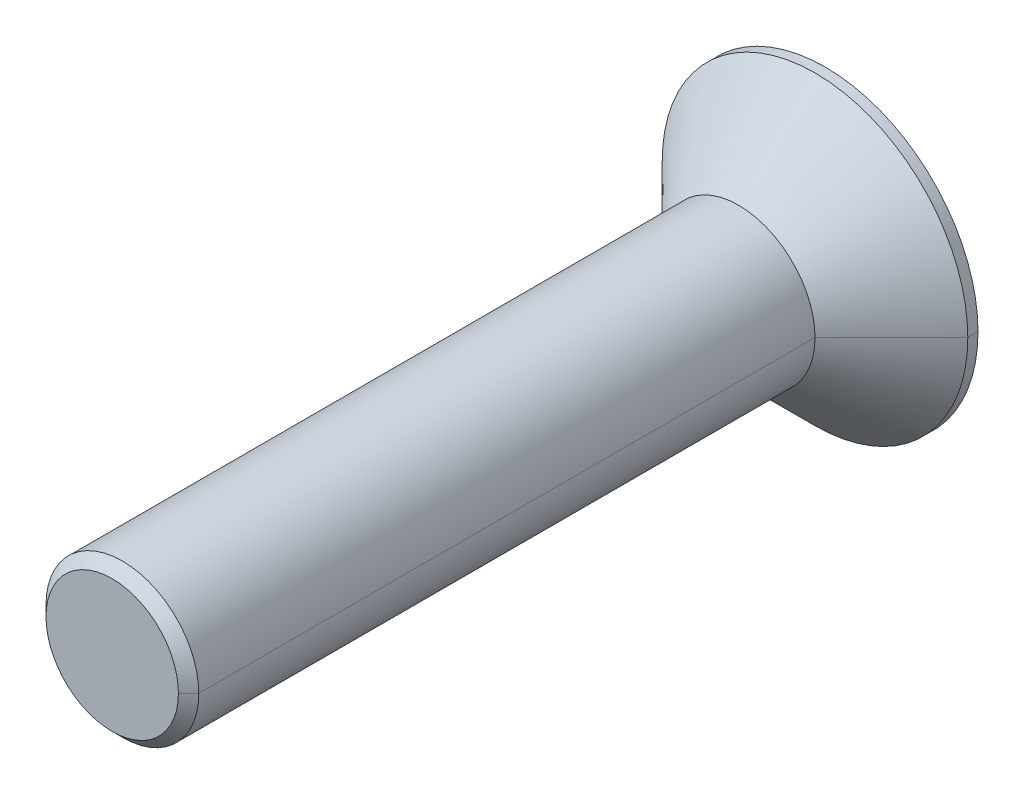
ISO-10303-21;
HEADER;
FILE_DESCRIPTION(('STEP AP214'),'2;1');
FILE_NAME('part.step','',(''),(''),'','','');
FILE_SCHEMA(('AUTOMOTIVE_DESIGN { 1 0 10303 214 1 1 1 1 }'));
ENDSEC;
DATA;
#1=APPLICATION_CONTEXT('core data for automotive mechanical design processes');
#2=APPLICATION_PROTOCOL_DEFINITION('international standard','automotive_design',2000,#1);
#3=PRODUCT_CONTEXT('',#1,'mechanical');
#4=PRODUCT('Part','Part','',(#3));
#5=PRODUCT_RELATED_PRODUCT_CATEGORY('part','',(#4));
#6=PRODUCT_DEFINITION_FORMATION('','',#4);
#7=PRODUCT_DEFINITION_CONTEXT('part definition',#1,'design');
#8=PRODUCT_DEFINITION('design','',#6,#7);
#9=PRODUCT_DEFINITION_SHAPE('','',#8);
#10=(LENGTH_UNIT() NAMED_UNIT(*) SI_UNIT(.MILLI.,.METRE.));
#11=(NAMED_UNIT(*) PLANE_ANGLE_UNIT() SI_UNIT($,.RADIAN.));
#12=(NAMED_UNIT(*) SI_UNIT($,.STERADIAN.) SOLID_ANGLE_UNIT());
#13=UNCERTAINTY_MEASURE_WITH_UNIT(LENGTH_MEASURE(1.E-05),#10,'distance_accuracy_value','');
#14=(GEOMETRIC_REPRESENTATION_CONTEXT(3) GLOBAL_UNCERTAINTY_ASSIGNED_CONTEXT((#13)) GLOBAL_UNIT_ASSIGNED_CONTEXT((#10,
#11,#12)) REPRESENTATION_CONTEXT('',''));
#15=CARTESIAN_POINT('',(0.,0.,0.));
#16=DIRECTION('',(0.,0.,1.));
#17=DIRECTION('',(1.,0.,0.));
#18=AXIS2_PLACEMENT_3D('',#15,#16,#17);
#19=CARTESIAN_POINT('',(0.,0.,-0.2));
#20=DIRECTION('',(0.,0.,-1.));
#21=DIRECTION('',(0.,-1.,0.));
#22=AXIS2_PLACEMENT_3D('',#19,#20,#21);
#23=PLANE('',#22);
#24=DIRECTION('',(-0.5,-0.866025403784439,0.));
#25=VECTOR('',#24,1.);
#26=CARTESIAN_POINT('',(1.15470053837925,0.,-0.2));
#27=LINE('',#26,#25);
#28=CARTESIAN_POINT('',(1.15470053837925,0.,-0.2));
#29=VERTEX_POINT('',#28);
#30=CARTESIAN_POINT('',(0.577350269189626,-1.,-0.2));
#31=VERTEX_POINT('',#30);
#32=EDGE_CURVE('E242',#29,#31,#27,.T.);
#33=ORIENTED_EDGE('',*,*,#32,.T.);
#34=DIRECTION('',(-1.,0.,0.));
#35=VECTOR('',#34,1.);
#36=CARTESIAN_POINT('',(0.577350269189626,-1.,-0.2));
#37=LINE('',#36,#35);
#38=CARTESIAN_POINT('',(-0.577350269189626,-1.,-0.2));
#39=VERTEX_POINT('',#38);
#40=EDGE_CURVE('E11',#31,#39,#37,.T.);
#41=ORIENTED_EDGE('',*,*,#40,.T.);
#42=DIRECTION('',(-0.5,0.866025403784439,0.));
#43=VECTOR('',#42,1.);
#44=CARTESIAN_POINT('',(-0.577350269189626,-1.,-0.2));
#45=LINE('',#44,#43);
#46=CARTESIAN_POINT('',(-1.15470053837925,0.,-0.2));
#47=VERTEX_POINT('',#46);
#48=EDGE_CURVE('E44',#39,#47,#45,.T.);
#49=ORIENTED_EDGE('',*,*,#48,.T.);
#50=DIRECTION('',(0.5,0.866025403784439,0.));
#51=VECTOR('',#50,1.);
#52=CARTESIAN_POINT('',(-1.15470053837925,0.,-0.2));
#53=LINE('',#52,#51);
#54=CARTESIAN_POINT('',(-0.577350269189627,1.,-0.2));
#55=VERTEX_POINT('',#54);
#56=EDGE_CURVE('E255',#47,#55,#53,.T.);
#57=ORIENTED_EDGE('',*,*,#56,.T.);
#58=DIRECTION('',(1.,0.,0.));
#59=VECTOR('',#58,1.);
#60=CARTESIAN_POINT('',(-0.577350269189627,1.,-0.2));
#61=LINE('',#60,#59);
#62=CARTESIAN_POINT('',(0.577350269189626,1.,-0.2));
#63=VERTEX_POINT('',#62);
#64=EDGE_CURVE('E209',#55,#63,#61,.T.);
#65=ORIENTED_EDGE('',*,*,#64,.T.);
#66=DIRECTION('',(0.5,-0.866025403784439,0.));
#67=VECTOR('',#66,1.);
#68=CARTESIAN_POINT('',(0.577350269189626,1.,-0.2));
#69=LINE('',#68,#67);
#70=EDGE_CURVE('E248',#63,#29,#69,.T.);
#71=ORIENTED_EDGE('',*,*,#70,.T.);
#72=EDGE_LOOP('',(#33,#41,#49,#57,#65,#71));
#73=FACE_BOUND('',#72,.T.);
#74=ADVANCED_FACE('F17',(#73),#23,.T.);
#75=CARTESIAN_POINT('',(0.577350269189626,-1.,-0.2));
#76=DIRECTION('',(0.,-1.,0.));
#77=DIRECTION('',(0.,0.,-1.));
#78=AXIS2_PLACEMENT_3D('',#75,#76,#77);
#79=PLANE('',#78);
#80=DIRECTION('',(-1.,0.,0.));
#81=VECTOR('',#80,1.);
#82=CARTESIAN_POINT('',(0.577350269189626,-1.,-1.7));
#83=LINE('',#82,#81);
#84=CARTESIAN_POINT('',(0.577350269189626,-1.,-1.7));
#85=VERTEX_POINT('',#84);
#86=CARTESIAN_POINT('',(-0.577350269189626,-1.,-1.7));
#87=VERTEX_POINT('',#86);
#88=EDGE_CURVE('E208',#85,#87,#83,.T.);
#89=ORIENTED_EDGE('',*,*,#88,.T.);
#90=DIRECTION('',(0.,0.,-1.));
#91=VECTOR('',#90,1.);
#92=CARTESIAN_POINT('',(-0.577350269189626,-1.,-0.2));
#93=LINE('',#92,#91);
#94=EDGE_CURVE('E25',#39,#87,#93,.T.);
#95=ORIENTED_EDGE('',*,*,#94,.F.);
#96=ORIENTED_EDGE('',*,*,#40,.F.);
#97=DIRECTION('',(0.,0.,-1.));
#98=VECTOR('',#97,1.);
#99=CARTESIAN_POINT('',(0.577350269189626,-1.,-0.2));
#100=LINE('',#99,#98);
#101=EDGE_CURVE('E239',#31,#85,#100,.T.);
#102=ORIENTED_EDGE('',*,*,#101,.T.);
#103=EDGE_LOOP('',(#89,#95,#96,#102));
#104=FACE_BOUND('',#103,.T.);
#105=ADVANCED_FACE('F508',(#104),#79,.F.);
#106=CARTESIAN_POINT('',(-0.577350269189626,-1.,-0.2));
#107=DIRECTION('',(-0.866025403784439,-0.5,0.));
#108=DIRECTION('',(-0.5,0.866025403784439,0.));
#109=AXIS2_PLACEMENT_3D('',#106,#107,#108);
#110=PLANE('',#109);
#111=DIRECTION('',(-0.5,0.866025403784439,0.));
#112=VECTOR('',#111,1.);
#113=CARTESIAN_POINT('',(-0.577350269189626,-1.,-1.7));
#114=LINE('',#113,#112);
#115=CARTESIAN_POINT('',(-1.15470053837925,0.,-1.7));
#116=VERTEX_POINT('',#115);
#117=EDGE_CURVE('E233',#87,#116,#114,.T.);
#118=ORIENTED_EDGE('',*,*,#117,.T.);
#119=DIRECTION('',(0.,0.,-1.));
#120=VECTOR('',#119,1.);
#121=CARTESIAN_POINT('',(-1.15470053837925,0.,-0.2));
#122=LINE('',#121,#120);
#123=EDGE_CURVE('E258',#47,#116,#122,.T.);
#124=ORIENTED_EDGE('',*,*,#123,.F.);
#125=ORIENTED_EDGE('',*,*,#48,.F.);
#126=ORIENTED_EDGE('',*,*,#94,.T.);
#127=EDGE_LOOP('',(#118,#124,#125,#126));
#128=FACE_BOUND('',#127,.T.);
#129=ADVANCED_FACE('F512',(#128),#110,.F.);
#130=CARTESIAN_POINT('',(-1.15470053837925,0.,-0.2));
#131=DIRECTION('',(-0.866025403784439,0.5,0.));
#132=DIRECTION('',(0.,0.,1.));
#133=AXIS2_PLACEMENT_3D('',#130,#131,#132);
#134=PLANE('',#133);
#135=DIRECTION('',(0.5,0.866025403784439,0.));
#136=VECTOR('',#135,1.);
#137=CARTESIAN_POINT('',(-1.15470053837925,0.,-1.7));
#138=LINE('',#137,#136);
#139=CARTESIAN_POINT('',(-0.577350269189627,1.,-1.7));
#140=VERTEX_POINT('',#139);
#141=EDGE_CURVE('E229',#116,#140,#138,.T.);
#142=ORIENTED_EDGE('',*,*,#141,.T.);
#143=DIRECTION('',(0.,0.,-1.));
#144=VECTOR('',#143,1.);
#145=CARTESIAN_POINT('',(-0.577350269189627,1.,-0.2));
#146=LINE('',#145,#144);
#147=EDGE_CURVE('E212',#55,#140,#146,.T.);
#148=ORIENTED_EDGE('',*,*,#147,.F.);
#149=ORIENTED_EDGE('',*,*,#56,.F.);
#150=ORIENTED_EDGE('',*,*,#123,.T.);
#151=EDGE_LOOP('',(#142,#148,#149,#150));
#152=FACE_BOUND('',#151,.T.);
#153=ADVANCED_FACE('F449',(#152),#134,.F.);
#154=CARTESIAN_POINT('',(-0.577350269189627,1.,-0.2));
#155=DIRECTION('',(0.,1.,0.));
#156=DIRECTION('',(1.,0.,0.));
#157=AXIS2_PLACEMENT_3D('',#154,#155,#156);
#158=PLANE('',#157);
#159=DIRECTION('',(1.,0.,0.));
#160=VECTOR('',#159,1.);
#161=CARTESIAN_POINT('',(-0.577350269189627,1.,-1.7));
#162=LINE('',#161,#160);
#163=CARTESIAN_POINT('',(0.577350269189626,1.,-1.7));
#164=VERTEX_POINT('',#163);
#165=EDGE_CURVE('E225',#140,#164,#162,.T.);
#166=ORIENTED_EDGE('',*,*,#165,.T.);
#167=DIRECTION('',(0.,0.,-1.));
#168=VECTOR('',#167,1.);
#169=CARTESIAN_POINT('',(0.577350269189626,1.,-0.2));
#170=LINE('',#169,#168);
#171=EDGE_CURVE('E213',#63,#164,#170,.T.);
#172=ORIENTED_EDGE('',*,*,#171,.F.);
#173=ORIENTED_EDGE('',*,*,#64,.F.);
#174=ORIENTED_EDGE('',*,*,#147,.T.);
#175=EDGE_LOOP('',(#166,#172,#173,#174));
#176=FACE_BOUND('',#175,.T.);
#177=ADVANCED_FACE('F444',(#176),#158,.F.);
#178=CARTESIAN_POINT('',(0.577350269189626,1.,-0.2));
#179=DIRECTION('',(0.866025403784439,0.5,0.));
#180=DIRECTION('',(0.,0.,-1.));
#181=AXIS2_PLACEMENT_3D('',#178,#179,#180);
#182=PLANE('',#181);
#183=DIRECTION('',(0.5,-0.866025403784439,0.));
#184=VECTOR('',#183,1.);
#185=CARTESIAN_POINT('',(0.577350269189626,1.,-1.7));
#186=LINE('',#185,#184);
#187=CARTESIAN_POINT('',(1.15470053837925,0.,-1.7));
#188=VERTEX_POINT('',#187);
#189=EDGE_CURVE('E221',#164,#188,#186,.T.);
#190=ORIENTED_EDGE('',*,*,#189,.T.);
#191=DIRECTION('',(0.,0.,-1.));
#192=VECTOR('',#191,1.);
#193=CARTESIAN_POINT('',(1.15470053837925,0.,-0.2));
#194=LINE('',#193,#192);
#195=EDGE_CURVE('E245',#29,#188,#194,.T.);
#196=ORIENTED_EDGE('',*,*,#195,.F.);
#197=ORIENTED_EDGE('',*,*,#70,.F.);
#198=ORIENTED_EDGE('',*,*,#171,.T.);
#199=EDGE_LOOP('',(#190,#196,#197,#198));
#200=FACE_BOUND('',#199,.T.);
#201=ADVANCED_FACE('F448',(#200),#182,.F.);
#202=CARTESIAN_POINT('',(1.15470053837925,0.,-0.2));
#203=DIRECTION('',(0.866025403784439,-0.5,0.));
#204=DIRECTION('',(0.,0.,-1.));
#205=AXIS2_PLACEMENT_3D('',#202,#203,#204);
#206=PLANE('',#205);
#207=DIRECTION('',(-0.5,-0.866025403784439,0.));
#208=VECTOR('',#207,1.);
#209=CARTESIAN_POINT('',(1.15470053837925,0.,-1.7));
#210=LINE('',#209,#208);
#211=EDGE_CURVE('E217',#188,#85,#210,.T.);
#212=ORIENTED_EDGE('',*,*,#211,.T.);
#213=ORIENTED_EDGE('',*,*,#101,.F.);
#214=ORIENTED_EDGE('',*,*,#32,.F.);
#215=ORIENTED_EDGE('',*,*,#195,.T.);
#216=EDGE_LOOP('',(#212,#213,#214,#215));
#217=FACE_BOUND('',#216,.T.);
#218=ADVANCED_FACE('F553',(#217),#206,.F.);
#219=CARTESIAN_POINT('',(0.,0.,12.3));
#220=DIRECTION('',(0.,0.,-1.));
#221=DIRECTION('',(-1.,0.,0.));
#222=AXIS2_PLACEMENT_3D('',#219,#220,#221);
#223=CONICAL_SURFACE('',#222,1.3,0.78539816339745);
#224=DIRECTION('',(0.707106781186549,0.,-0.707106781186546));
#225=VECTOR('',#224,1.);
#226=CARTESIAN_POINT('',(1.3,0.,12.3));
#227=LINE('',#226,#225);
#228=CARTESIAN_POINT('',(1.3,0.,12.3));
#229=VERTEX_POINT('',#228);
#230=CARTESIAN_POINT('',(1.5,0.,12.1));
#231=VERTEX_POINT('',#230);
#232=EDGE_CURVE('E140',#229,#231,#227,.T.);
#233=ORIENTED_EDGE('',*,*,#232,.F.);
#234=CARTESIAN_POINT('',(0.,0.,12.3));
#235=DIRECTION('',(0.,0.,1.));
#236=DIRECTION('',(1.,0.,0.));
#237=AXIS2_PLACEMENT_3D('',#234,#235,#236);
#238=CIRCLE('',#237,1.3);
#239=CARTESIAN_POINT('',(-1.3,0.,12.3));
#240=VERTEX_POINT('',#239);
#241=EDGE_CURVE('E127',#240,#229,#238,.T.);
#242=ORIENTED_EDGE('',*,*,#241,.F.);
#243=DIRECTION('',(-0.707106781186549,0.,-0.707106781186546));
#244=VECTOR('',#243,1.);
#245=CARTESIAN_POINT('',(-1.3,0.,12.3));
#246=LINE('',#245,#244);
#247=CARTESIAN_POINT('',(-1.5,0.,12.1));
#248=VERTEX_POINT('',#247);
#249=EDGE_CURVE('E149',#240,#248,#246,.T.);
#250=ORIENTED_EDGE('',*,*,#249,.T.);
#251=CARTESIAN_POINT('',(0.,0.,12.1));
#252=DIRECTION('',(0.,0.,-1.));
#253=DIRECTION('',(1.,0.,0.));
#254=AXIS2_PLACEMENT_3D('',#251,#252,#253);
#255=CIRCLE('',#254,1.5);
#256=EDGE_CURVE('E137',#231,#248,#255,.T.);
#257=ORIENTED_EDGE('',*,*,#256,.F.);
#258=EDGE_LOOP('',(#233,#242,#250,#257));
#259=FACE_BOUND('',#258,.T.);
#260=ADVANCED_FACE('F141',(#259),#223,.T.);
#261=CARTESIAN_POINT('',(0.,0.,-1.7));
#262=DIRECTION('',(0.,0.,1.));
#263=DIRECTION('',(1.,0.,0.));
#264=AXIS2_PLACEMENT_3D('',#261,#262,#263);
#265=PLANE('',#264);
#266=ORIENTED_EDGE('',*,*,#88,.F.);
#267=ORIENTED_EDGE('',*,*,#211,.F.);
#268=ORIENTED_EDGE('',*,*,#189,.F.);
#269=ORIENTED_EDGE('',*,*,#165,.F.);
#270=ORIENTED_EDGE('',*,*,#141,.F.);
#271=ORIENTED_EDGE('',*,*,#117,.F.);
#272=EDGE_LOOP('',(#266,#267,#268,#269,#270,#271));
#273=FACE_BOUND('',#272,.T.);
#274=CARTESIAN_POINT('',(0.,0.,-1.7));
#275=DIRECTION('',(0.,0.,-1.));
#276=DIRECTION('',(-1.,0.,0.));
#277=AXIS2_PLACEMENT_3D('',#274,#275,#276);
#278=CIRCLE('',#277,3.);
#279=CARTESIAN_POINT('',(-3.,0.,-1.7));
#280=VERTEX_POINT('',#279);
#281=CARTESIAN_POINT('',(3.,0.,-1.7));
#282=VERTEX_POINT('',#281);
#283=EDGE_CURVE('E192',#280,#282,#278,.T.);
#284=ORIENTED_EDGE('',*,*,#283,.T.);
#285=CARTESIAN_POINT('',(0.,0.,-1.7));
#286=DIRECTION('',(0.,0.,-1.));
#287=DIRECTION('',(-1.,0.,0.));
#288=AXIS2_PLACEMENT_3D('',#285,#286,#287);
#289=CIRCLE('',#288,3.);
#290=EDGE_CURVE('E136',#282,#280,#289,.T.);
#291=ORIENTED_EDGE('',*,*,#290,.T.);
#292=EDGE_LOOP('',(#284,#291));
#293=FACE_BOUND('',#292,.T.);
#294=ADVANCED_FACE('F463',(#273,#293),#265,.F.);
#295=CARTESIAN_POINT('',(0.,0.,12.3));
#296=DIRECTION('',(0.,0.,-1.));
#297=DIRECTION('',(-1.,0.,0.));
#298=AXIS2_PLACEMENT_3D('',#295,#296,#297);
#299=CYLINDRICAL_SURFACE('',#298,3.);
#300=DIRECTION('',(0.,0.,-1.));
#301=VECTOR('',#300,1.);
#302=CARTESIAN_POINT('',(3.,0.,12.3));
#303=LINE('',#302,#301);
#304=CARTESIAN_POINT('',(3.,0.,-1.5));
#305=VERTEX_POINT('',#304);
#306=EDGE_CURVE('E185',#305,#282,#303,.T.);
#307=ORIENTED_EDGE('',*,*,#306,.F.);
#308=CARTESIAN_POINT('',(0.,0.,-1.5));
#309=DIRECTION('',(0.,0.,1.));
#310=DIRECTION('',(-1.,0.,0.));
#311=AXIS2_PLACEMENT_3D('',#308,#309,#310);
#312=CIRCLE('',#311,3.);
#313=CARTESIAN_POINT('',(-3.,0.,-1.5));
#314=VERTEX_POINT('',#313);
#315=EDGE_CURVE('E162',#314,#305,#312,.T.);
#316=ORIENTED_EDGE('',*,*,#315,.F.);
#317=DIRECTION('',(0.,0.,-1.));
#318=VECTOR('',#317,1.);
#319=CARTESIAN_POINT('',(-3.,0.,12.3));
#320=LINE('',#319,#318);
#321=EDGE_CURVE('E160',#314,#280,#320,.T.);
#322=ORIENTED_EDGE('',*,*,#321,.T.);
#323=ORIENTED_EDGE('',*,*,#290,.F.);
#324=EDGE_LOOP('',(#307,#316,#322,#323));
#325=FACE_BOUND('',#324,.T.);
#326=ADVANCED_FACE('F467',(#325),#299,.T.);
#327=CARTESIAN_POINT('',(0.,0.,12.3));
#328=DIRECTION('',(0.,0.,1.));
#329=DIRECTION('',(1.,0.,0.));
#330=AXIS2_PLACEMENT_3D('',#327,#328,#329);
#331=PLANE('',#330);
#332=ORIENTED_EDGE('',*,*,#241,.T.);
#333=CARTESIAN_POINT('',(0.,0.,12.3));
#334=DIRECTION('',(0.,0.,1.));
#335=DIRECTION('',(1.,0.,0.));
#336=AXIS2_PLACEMENT_3D('',#333,#334,#335);
#337=CIRCLE('',#336,1.3);
#338=EDGE_CURVE('E131',#229,#240,#337,.T.);
#339=ORIENTED_EDGE('',*,*,#338,.T.);
#340=EDGE_LOOP('',(#332,#339));
#341=FACE_BOUND('',#340,.T.);
#342=ADVANCED_FACE('F129',(#341),#331,.T.);
#343=CARTESIAN_POINT('',(0.,0.,12.3));
#344=DIRECTION('',(0.,0.,-1.));
#345=DIRECTION('',(-1.,0.,0.));
#346=AXIS2_PLACEMENT_3D('',#343,#344,#345);
#347=CYLINDRICAL_SURFACE('',#346,1.5);
#348=DIRECTION('',(0.,0.,-1.));
#349=VECTOR('',#348,1.);
#350=CARTESIAN_POINT('',(1.5,0.,12.3));
#351=LINE('',#350,#349);
#352=CARTESIAN_POINT('',(1.5,0.,0.));
#353=VERTEX_POINT('',#352);
#354=EDGE_CURVE('E156',#231,#353,#351,.T.);
#355=ORIENTED_EDGE('',*,*,#354,.F.);
#356=ORIENTED_EDGE('',*,*,#256,.T.);
#357=DIRECTION('',(0.,0.,-1.));
#358=VECTOR('',#357,1.);
#359=CARTESIAN_POINT('',(-1.5,0.,12.3));
#360=LINE('',#359,#358);
#361=CARTESIAN_POINT('',(-1.5,0.,0.));
#362=VERTEX_POINT('',#361);
#363=EDGE_CURVE('E174',#248,#362,#360,.T.);
#364=ORIENTED_EDGE('',*,*,#363,.T.);
#365=CARTESIAN_POINT('',(0.,0.,0.));
#366=DIRECTION('',(0.,0.,1.));
#367=DIRECTION('',(1.,0.,0.));
#368=AXIS2_PLACEMENT_3D('',#365,#366,#367);
#369=CIRCLE('',#368,1.5);
#370=EDGE_CURVE('E178',#362,#353,#369,.T.);
#371=ORIENTED_EDGE('',*,*,#370,.T.);
#372=EDGE_LOOP('',(#355,#356,#364,#371));
#373=FACE_BOUND('',#372,.T.);
#374=ADVANCED_FACE('F518',(#373),#347,.T.);
#375=CARTESIAN_POINT('',(0.,0.,0.));
#376=DIRECTION('',(0.,0.,-1.));
#377=DIRECTION('',(1.,0.,0.));
#378=AXIS2_PLACEMENT_3D('',#375,#376,#377);
#379=CONICAL_SURFACE('',#378,1.5,0.78539816339745);
#380=DIRECTION('',(-0.707106781186549,0.,-0.707106781186546));
#381=VECTOR('',#380,1.);
#382=CARTESIAN_POINT('',(-1.5,0.,0.));
#383=LINE('',#382,#381);
#384=EDGE_CURVE('E167',#362,#314,#383,.T.);
#385=ORIENTED_EDGE('',*,*,#384,.F.);
#386=CARTESIAN_POINT('',(0.,0.,0.));
#387=DIRECTION('',(0.,0.,1.));
#388=DIRECTION('',(1.,0.,0.));
#389=AXIS2_PLACEMENT_3D('',#386,#387,#388);
#390=CIRCLE('',#389,1.5);
#391=EDGE_CURVE('E159',#353,#362,#390,.T.);
#392=ORIENTED_EDGE('',*,*,#391,.F.);
#393=DIRECTION('',(0.707106781186549,0.,-0.707106781186546));
#394=VECTOR('',#393,1.);
#395=CARTESIAN_POINT('',(1.5,0.,0.));
#396=LINE('',#395,#394);
#397=EDGE_CURVE('E166',#353,#305,#396,.T.);
#398=ORIENTED_EDGE('',*,*,#397,.T.);
#399=CARTESIAN_POINT('',(0.,0.,-1.5));
#400=DIRECTION('',(0.,0.,1.));
#401=DIRECTION('',(-1.,0.,0.));
#402=AXIS2_PLACEMENT_3D('',#399,#400,#401);
#403=CIRCLE('',#402,3.);
#404=EDGE_CURVE('E170',#305,#314,#403,.T.);
#405=ORIENTED_EDGE('',*,*,#404,.T.);
#406=EDGE_LOOP('',(#385,#392,#398,#405));
#407=FACE_BOUND('',#406,.T.);
#408=ADVANCED_FACE('F502',(#407),#379,.T.);
#409=CARTESIAN_POINT('',(0.,0.,0.));
#410=DIRECTION('',(0.,0.,-1.));
#411=DIRECTION('',(1.,0.,0.));
#412=AXIS2_PLACEMENT_3D('',#409,#410,#411);
#413=CONICAL_SURFACE('',#412,1.5,0.78539816339745);
#414=ORIENTED_EDGE('',*,*,#370,.F.);
#415=ORIENTED_EDGE('',*,*,#384,.T.);
#416=ORIENTED_EDGE('',*,*,#315,.T.);
#417=ORIENTED_EDGE('',*,*,#397,.F.);
#418=EDGE_LOOP('',(#414,#415,#416,#417));
#419=FACE_BOUND('',#418,.T.);
#420=ADVANCED_FACE('F485',(#419),#413,.T.);
#421=CARTESIAN_POINT('',(0.,0.,12.3));
#422=DIRECTION('',(0.,0.,-1.));
#423=DIRECTION('',(-1.,0.,0.));
#424=AXIS2_PLACEMENT_3D('',#421,#422,#423);
#425=CYLINDRICAL_SURFACE('',#424,1.5);
#426=CARTESIAN_POINT('',(0.,0.,12.1));
#427=DIRECTION('',(0.,0.,-1.));
#428=DIRECTION('',(1.,0.,0.));
#429=AXIS2_PLACEMENT_3D('',#426,#427,#428);
#430=CIRCLE('',#429,1.5);
#431=EDGE_CURVE('E146',#248,#231,#430,.T.);
#432=ORIENTED_EDGE('',*,*,#431,.T.);
#433=ORIENTED_EDGE('',*,*,#354,.T.);
#434=ORIENTED_EDGE('',*,*,#391,.T.);
#435=ORIENTED_EDGE('',*,*,#363,.F.);
#436=EDGE_LOOP('',(#432,#433,#434,#435));
#437=FACE_BOUND('',#436,.T.);
#438=ADVANCED_FACE('F476',(#437),#425,.T.);
#439=CARTESIAN_POINT('',(0.,0.,12.3));
#440=DIRECTION('',(0.,0.,-1.));
#441=DIRECTION('',(-1.,0.,0.));
#442=AXIS2_PLACEMENT_3D('',#439,#440,#441);
#443=CYLINDRICAL_SURFACE('',#442,3.);
#444=ORIENTED_EDGE('',*,*,#404,.F.);
#445=ORIENTED_EDGE('',*,*,#306,.T.);
#446=ORIENTED_EDGE('',*,*,#283,.F.);
#447=ORIENTED_EDGE('',*,*,#321,.F.);
#448=EDGE_LOOP('',(#444,#445,#446,#447));
#449=FACE_BOUND('',#448,.T.);
#450=ADVANCED_FACE('F458',(#449),#443,.T.);
#451=CARTESIAN_POINT('',(0.,0.,12.3));
#452=DIRECTION('',(0.,0.,-1.));
#453=DIRECTION('',(-1.,0.,0.));
#454=AXIS2_PLACEMENT_3D('',#451,#452,#453);
#455=CONICAL_SURFACE('',#454,1.3,0.78539816339745);
#456=ORIENTED_EDGE('',*,*,#338,.F.);
#457=ORIENTED_EDGE('',*,*,#232,.T.);
#458=ORIENTED_EDGE('',*,*,#431,.F.);
#459=ORIENTED_EDGE('',*,*,#249,.F.);
#460=EDGE_LOOP('',(#456,#457,#458,#459));
#461=FACE_BOUND('',#460,.T.);
#462=ADVANCED_FACE('F148',(#461),#455,.T.);
#463=CLOSED_SHELL('',(#74,#105,#129,#153,#177,#201,#218,#260,#294,#326,#342,#374,#408,#420,#438,
#450,#462));
#464=MANIFOLD_SOLID_BREP('B1',#463);
#465=ADVANCED_BREP_SHAPE_REPRESENTATION('',(#18,#464),#14);
#466=SHAPE_DEFINITION_REPRESENTATION(#9,#465);
ENDSEC;
END-ISO-10303-21;
